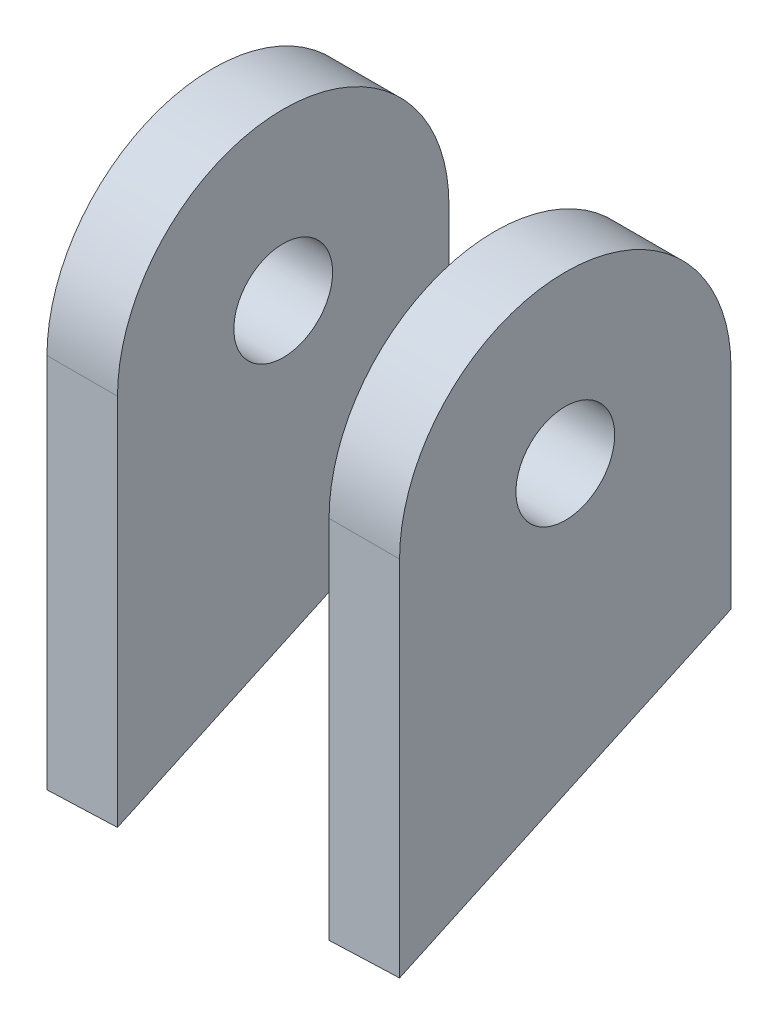
ISO-10303-21;
HEADER;
FILE_DESCRIPTION(('STEP AP214'),'2;1');
FILE_NAME('part.step','',(''),(''),'','','');
FILE_SCHEMA(('AUTOMOTIVE_DESIGN { 1 0 10303 214 1 1 1 1 }'));
ENDSEC;
DATA;
#1=APPLICATION_CONTEXT('core data for automotive mechanical design processes');
#2=APPLICATION_PROTOCOL_DEFINITION('international standard','automotive_design',2000,#1);
#3=PRODUCT_CONTEXT('',#1,'mechanical');
#4=PRODUCT('Part','Part','',(#3));
#5=PRODUCT_RELATED_PRODUCT_CATEGORY('part','',(#4));
#6=PRODUCT_DEFINITION_FORMATION('','',#4);
#7=PRODUCT_DEFINITION_CONTEXT('part definition',#1,'design');
#8=PRODUCT_DEFINITION('design','',#6,#7);
#9=PRODUCT_DEFINITION_SHAPE('','',#8);
#10=(LENGTH_UNIT() NAMED_UNIT(*) SI_UNIT(.MILLI.,.METRE.));
#11=(NAMED_UNIT(*) PLANE_ANGLE_UNIT() SI_UNIT($,.RADIAN.));
#12=(NAMED_UNIT(*) SI_UNIT($,.STERADIAN.) SOLID_ANGLE_UNIT());
#13=UNCERTAINTY_MEASURE_WITH_UNIT(LENGTH_MEASURE(1.E-05),#10,'distance_accuracy_value','');
#14=(GEOMETRIC_REPRESENTATION_CONTEXT(3) GLOBAL_UNCERTAINTY_ASSIGNED_CONTEXT((#13)) GLOBAL_UNIT_ASSIGNED_CONTEXT((#10,
#11,#12)) REPRESENTATION_CONTEXT('',''));
#15=CARTESIAN_POINT('',(0.,0.,0.));
#16=DIRECTION('',(0.,0.,1.));
#17=DIRECTION('',(1.,0.,0.));
#18=AXIS2_PLACEMENT_3D('',#15,#16,#17);
#19=CARTESIAN_POINT('',(-40.,0.,0.));
#20=DIRECTION('',(1.,0.,0.));
#21=DIRECTION('',(0.,0.,-1.));
#22=AXIS2_PLACEMENT_3D('',#19,#20,#21);
#23=CYLINDRICAL_SURFACE('',#22,23.5);
#24=DIRECTION('',(1.,0.,0.));
#25=VECTOR('',#24,1.);
#26=CARTESIAN_POINT('',(-39.9999999999995,-3.60822483003176E-13,23.4999999999997));
#27=LINE('',#26,#25);
#28=CARTESIAN_POINT('',(-39.9999999999995,-3.60822483003176E-13,23.4999999999997));
#29=VERTEX_POINT('',#28);
#30=CARTESIAN_POINT('',(-30.,0.,23.5000000000001));
#31=VERTEX_POINT('',#30);
#32=EDGE_CURVE('E110',#29,#31,#27,.T.);
#33=ORIENTED_EDGE('',*,*,#32,.T.);
#34=CARTESIAN_POINT('',(-30.,0.,0.));
#35=DIRECTION('',(1.,0.,0.));
#36=DIRECTION('',(0.,0.,-1.));
#37=AXIS2_PLACEMENT_3D('',#34,#35,#36);
#38=CIRCLE('',#37,23.5);
#39=CARTESIAN_POINT('',(-30.,0.,-23.5));
#40=VERTEX_POINT('',#39);
#41=EDGE_CURVE('E96',#40,#31,#38,.T.);
#42=ORIENTED_EDGE('',*,*,#41,.F.);
#43=DIRECTION('',(1.,0.,0.));
#44=VECTOR('',#43,1.);
#45=CARTESIAN_POINT('',(-40.,0.,-23.5000000000001));
#46=LINE('',#45,#44);
#47=CARTESIAN_POINT('',(-40.,0.,-23.5000000000001));
#48=VERTEX_POINT('',#47);
#49=EDGE_CURVE('E106',#48,#40,#46,.T.);
#50=ORIENTED_EDGE('',*,*,#49,.F.);
#51=CARTESIAN_POINT('',(-40.,0.,0.));
#52=DIRECTION('',(1.,0.,0.));
#53=DIRECTION('',(0.,0.,-1.));
#54=AXIS2_PLACEMENT_3D('',#51,#52,#53);
#55=CIRCLE('',#54,23.5);
#56=EDGE_CURVE('E109',#48,#29,#55,.T.);
#57=ORIENTED_EDGE('',*,*,#56,.T.);
#58=EDGE_LOOP('',(#33,#42,#50,#57));
#59=FACE_BOUND('',#58,.T.);
#60=ADVANCED_FACE('F44',(#59),#23,.T.);
#61=CARTESIAN_POINT('',(-40.,0.,-23.5000000000001));
#62=DIRECTION('',(0.,0.,-1.));
#63=DIRECTION('',(0.,1.,0.));
#64=AXIS2_PLACEMENT_3D('',#61,#62,#63);
#65=PLANE('',#64);
#66=DIRECTION('',(0.999284837213827,0.0378128829175845,0.));
#67=VECTOR('',#66,1.);
#68=CARTESIAN_POINT('',(-38.8081814025562,-31.4963092269572,-23.5000000000001));
#69=LINE('',#68,#67);
#70=CARTESIAN_POINT('',(-40.0000000000001,-31.541407576703,-23.5000000000001));
#71=VERTEX_POINT('',#70);
#72=CARTESIAN_POINT('',(-30.,-31.1630081303246,-23.5000000000001));
#73=VERTEX_POINT('',#72);
#74=EDGE_CURVE('E58',#71,#73,#69,.T.);
#75=ORIENTED_EDGE('',*,*,#74,.F.);
#76=DIRECTION('',(0.,1.,0.));
#77=VECTOR('',#76,1.);
#78=CARTESIAN_POINT('',(-40.,0.,-23.5000000000001));
#79=LINE('',#78,#77);
#80=EDGE_CURVE('E108',#71,#48,#79,.T.);
#81=ORIENTED_EDGE('',*,*,#80,.T.);
#82=ORIENTED_EDGE('',*,*,#49,.T.);
#83=DIRECTION('',(0.,1.,0.));
#84=VECTOR('',#83,1.);
#85=CARTESIAN_POINT('',(-30.,0.,-23.5));
#86=LINE('',#85,#84);
#87=EDGE_CURVE('E52',#73,#40,#86,.T.);
#88=ORIENTED_EDGE('',*,*,#87,.F.);
#89=EDGE_LOOP('',(#75,#81,#82,#88));
#90=FACE_BOUND('',#89,.T.);
#91=ADVANCED_FACE('F139',(#90),#65,.T.);
#92=CARTESIAN_POINT('',(-39.9999999999995,-3.60822483003176E-13,23.4999999999997));
#93=DIRECTION('',(0.,0.,1.));
#94=DIRECTION('',(0.,-1.,0.));
#95=AXIS2_PLACEMENT_3D('',#92,#93,#94);
#96=PLANE('',#95);
#97=DIRECTION('',(-0.999284837213827,-0.0378128829175845,0.));
#98=VECTOR('',#97,1.);
#99=CARTESIAN_POINT('',(-37.9846331258456,-53.2603018699993,23.5));
#100=LINE('',#99,#98);
#101=CARTESIAN_POINT('',(-29.9999999999994,-52.9581637945642,23.5000000000004));
#102=VERTEX_POINT('',#101);
#103=CARTESIAN_POINT('',(-39.9999999999995,-53.3365632409427,23.5000000000009));
#104=VERTEX_POINT('',#103);
#105=EDGE_CURVE('E82',#102,#104,#100,.T.);
#106=ORIENTED_EDGE('',*,*,#105,.F.);
#107=DIRECTION('',(0.,-1.,0.));
#108=VECTOR('',#107,1.);
#109=CARTESIAN_POINT('',(-30.,0.,23.5000000000001));
#110=LINE('',#109,#108);
#111=EDGE_CURVE('E89',#31,#102,#110,.T.);
#112=ORIENTED_EDGE('',*,*,#111,.F.);
#113=ORIENTED_EDGE('',*,*,#32,.F.);
#114=DIRECTION('',(0.,-1.,0.));
#115=VECTOR('',#114,1.);
#116=CARTESIAN_POINT('',(-39.9999999999995,-3.60822483003176E-13,23.4999999999997));
#117=LINE('',#116,#115);
#118=EDGE_CURVE('E92',#29,#104,#117,.T.);
#119=ORIENTED_EDGE('',*,*,#118,.T.);
#120=EDGE_LOOP('',(#106,#112,#113,#119));
#121=FACE_BOUND('',#120,.T.);
#122=ADVANCED_FACE('F88',(#121),#96,.T.);
#123=CARTESIAN_POINT('',(-40.,0.,0.));
#124=DIRECTION('',(1.,0.,0.));
#125=DIRECTION('',(0.,0.,-1.));
#126=AXIS2_PLACEMENT_3D('',#123,#124,#125);
#127=CYLINDRICAL_SURFACE('',#126,7.);
#128=CARTESIAN_POINT('',(-40.,0.,0.));
#129=DIRECTION('',(1.,0.,0.));
#130=DIRECTION('',(0.,0.,-1.));
#131=AXIS2_PLACEMENT_3D('',#128,#129,#130);
#132=CIRCLE('',#131,7.);
#133=CARTESIAN_POINT('',(-40.,0.,-7.));
#134=VERTEX_POINT('',#133);
#135=EDGE_CURVE('E99',#134,#134,#132,.T.);
#136=ORIENTED_EDGE('',*,*,#135,.F.);
#137=EDGE_LOOP('',(#136));
#138=FACE_BOUND('',#137,.T.);
#139=CARTESIAN_POINT('',(-30.,0.,0.));
#140=DIRECTION('',(1.,0.,0.));
#141=DIRECTION('',(0.,0.,-1.));
#142=AXIS2_PLACEMENT_3D('',#139,#140,#141);
#143=CIRCLE('',#142,7.);
#144=CARTESIAN_POINT('',(-30.,0.,-7.));
#145=VERTEX_POINT('',#144);
#146=EDGE_CURVE('E103',#145,#145,#143,.T.);
#147=ORIENTED_EDGE('',*,*,#146,.T.);
#148=EDGE_LOOP('',(#147));
#149=FACE_BOUND('',#148,.T.);
#150=ADVANCED_FACE('F46',(#138,#149),#127,.F.);
#151=CARTESIAN_POINT('',(-40.,0.,0.));
#152=DIRECTION('',(1.,0.,0.));
#153=DIRECTION('',(0.,0.,-1.));
#154=AXIS2_PLACEMENT_3D('',#151,#152,#153);
#155=PLANE('',#154);
#156=ORIENTED_EDGE('',*,*,#135,.T.);
#157=EDGE_LOOP('',(#156));
#158=FACE_BOUND('',#157,.T.);
#159=ORIENTED_EDGE('',*,*,#80,.F.);
#160=DIRECTION('',(0.,-0.420694068240691,0.907202568860504));
#161=VECTOR('',#160,1.);
#162=CARTESIAN_POINT('',(-39.9999999999999,-34.927985274914,-16.1970399171278));
#163=LINE('',#162,#161);
#164=EDGE_CURVE('E111',#71,#104,#163,.T.);
#165=ORIENTED_EDGE('',*,*,#164,.T.);
#166=ORIENTED_EDGE('',*,*,#118,.F.);
#167=ORIENTED_EDGE('',*,*,#56,.F.);
#168=EDGE_LOOP('',(#159,#165,#166,#167));
#169=FACE_BOUND('',#168,.T.);
#170=ADVANCED_FACE('F124',(#158,#169),#155,.F.);
#171=CARTESIAN_POINT('',(-30.,0.,0.));
#172=DIRECTION('',(1.,0.,0.));
#173=DIRECTION('',(0.,0.,-1.));
#174=AXIS2_PLACEMENT_3D('',#171,#172,#173);
#175=PLANE('',#174);
#176=DIRECTION('',(0.,-0.420694068240691,0.907202568860504));
#177=VECTOR('',#176,1.);
#178=CARTESIAN_POINT('',(-29.9999999999998,-34.6165562865956,-16.0526219750267));
#179=LINE('',#178,#177);
#180=EDGE_CURVE('E12',#73,#102,#179,.T.);
#181=ORIENTED_EDGE('',*,*,#180,.F.);
#182=ORIENTED_EDGE('',*,*,#87,.T.);
#183=ORIENTED_EDGE('',*,*,#41,.T.);
#184=ORIENTED_EDGE('',*,*,#111,.T.);
#185=EDGE_LOOP('',(#181,#182,#183,#184));
#186=FACE_BOUND('',#185,.T.);
#187=ORIENTED_EDGE('',*,*,#146,.F.);
#188=EDGE_LOOP('',(#187));
#189=FACE_BOUND('',#188,.T.);
#190=ADVANCED_FACE('F94',(#186,#189),#175,.T.);
#191=CARTESIAN_POINT('',(1.27303500394915,-33.6426233213026,-15.6009832391736));
#192=DIRECTION('',(-0.0343082857094844,0.906668496422527,0.420446404582782));
#193=DIRECTION('',(0.,-0.420694068240691,0.907202568860504));
#194=AXIS2_PLACEMENT_3D('',#191,#192,#193);
#195=PLANE('',#194);
#196=ORIENTED_EDGE('',*,*,#74,.T.);
#197=ORIENTED_EDGE('',*,*,#180,.T.);
#198=ORIENTED_EDGE('',*,*,#105,.T.);
#199=ORIENTED_EDGE('',*,*,#164,.F.);
#200=EDGE_LOOP('',(#196,#197,#198,#199));
#201=FACE_BOUND('',#200,.T.);
#202=ADVANCED_FACE('F81',(#201),#195,.F.);
#203=CLOSED_SHELL('',(#60,#91,#122,#150,#170,#190,#202));
#204=MANIFOLD_SOLID_BREP('B2',#203);
#205=CARTESIAN_POINT('',(-40.,0.,23.5));
#206=DIRECTION('',(0.,0.,1.));
#207=DIRECTION('',(0.,-1.,0.));
#208=AXIS2_PLACEMENT_3D('',#205,#206,#207);
#209=PLANE('',#208);
#210=DIRECTION('',(-0.999284837213825,-0.0378128829175847,0.));
#211=VECTOR('',#210,1.);
#212=CARTESIAN_POINT('',(-37.9846331258456,-53.2603018699992,23.5));
#213=LINE('',#212,#211);
#214=CARTESIAN_POINT('',(9.99999999999999,-51.4445660090511,23.5));
#215=VERTEX_POINT('',#214);
#216=CARTESIAN_POINT('',(0.,-51.8229654554293,23.5));
#217=VERTEX_POINT('',#216);
#218=EDGE_CURVE('E190',#215,#217,#213,.T.);
#219=ORIENTED_EDGE('',*,*,#218,.F.);
#220=DIRECTION('',(0.,-1.,0.));
#221=VECTOR('',#220,1.);
#222=CARTESIAN_POINT('',(10.,0.,23.5));
#223=LINE('',#222,#221);
#224=CARTESIAN_POINT('',(10.,0.,23.5));
#225=VERTEX_POINT('',#224);
#226=EDGE_CURVE('E239',#225,#215,#223,.T.);
#227=ORIENTED_EDGE('',*,*,#226,.F.);
#228=DIRECTION('',(1.,0.,0.));
#229=VECTOR('',#228,1.);
#230=CARTESIAN_POINT('',(-40.,0.,23.5));
#231=LINE('',#230,#229);
#232=CARTESIAN_POINT('',(0.,0.,23.5));
#233=VERTEX_POINT('',#232);
#234=EDGE_CURVE('E243',#233,#225,#231,.T.);
#235=ORIENTED_EDGE('',*,*,#234,.F.);
#236=DIRECTION('',(0.,-1.,0.));
#237=VECTOR('',#236,1.);
#238=CARTESIAN_POINT('',(0.,0.,23.5));
#239=LINE('',#238,#237);
#240=EDGE_CURVE('E230',#233,#217,#239,.T.);
#241=ORIENTED_EDGE('',*,*,#240,.T.);
#242=EDGE_LOOP('',(#219,#227,#235,#241));
#243=FACE_BOUND('',#242,.T.);
#244=ADVANCED_FACE('F175',(#243),#209,.T.);
#245=CARTESIAN_POINT('',(-40.,0.,-23.5));
#246=DIRECTION('',(0.,0.,-1.));
#247=DIRECTION('',(0.,1.,0.));
#248=AXIS2_PLACEMENT_3D('',#245,#246,#247);
#249=PLANE('',#248);
#250=DIRECTION('',(0.999284837213825,0.0378128829175847,0.));
#251=VECTOR('',#250,1.);
#252=CARTESIAN_POINT('',(-38.8081814025563,-31.4963092269572,-23.5));
#253=LINE('',#252,#251);
#254=CARTESIAN_POINT('',(0.,-30.02780979119,-23.5));
#255=VERTEX_POINT('',#254);
#256=CARTESIAN_POINT('',(10.,-29.6494103448118,-23.5));
#257=VERTEX_POINT('',#256);
#258=EDGE_CURVE('E216',#255,#257,#253,.T.);
#259=ORIENTED_EDGE('',*,*,#258,.F.);
#260=DIRECTION('',(0.,1.,0.));
#261=VECTOR('',#260,1.);
#262=CARTESIAN_POINT('',(0.,0.,-23.5));
#263=LINE('',#262,#261);
#264=CARTESIAN_POINT('',(0.,0.,-23.5));
#265=VERTEX_POINT('',#264);
#266=EDGE_CURVE('E222',#255,#265,#263,.T.);
#267=ORIENTED_EDGE('',*,*,#266,.T.);
#268=DIRECTION('',(1.,0.,0.));
#269=VECTOR('',#268,1.);
#270=CARTESIAN_POINT('',(-40.,0.,-23.5));
#271=LINE('',#270,#269);
#272=CARTESIAN_POINT('',(10.,0.,-23.5));
#273=VERTEX_POINT('',#272);
#274=EDGE_CURVE('E183',#265,#273,#271,.T.);
#275=ORIENTED_EDGE('',*,*,#274,.T.);
#276=DIRECTION('',(0.,1.,0.));
#277=VECTOR('',#276,1.);
#278=CARTESIAN_POINT('',(10.,0.,-23.5));
#279=LINE('',#278,#277);
#280=EDGE_CURVE('E197',#257,#273,#279,.T.);
#281=ORIENTED_EDGE('',*,*,#280,.F.);
#282=EDGE_LOOP('',(#259,#267,#275,#281));
#283=FACE_BOUND('',#282,.T.);
#284=ADVANCED_FACE('F221',(#283),#249,.T.);
#285=CARTESIAN_POINT('',(-40.,0.,0.));
#286=DIRECTION('',(1.,0.,0.));
#287=DIRECTION('',(0.,0.,-1.));
#288=AXIS2_PLACEMENT_3D('',#285,#286,#287);
#289=CYLINDRICAL_SURFACE('',#288,23.5);
#290=CARTESIAN_POINT('',(0.,0.,0.));
#291=DIRECTION('',(1.,0.,0.));
#292=DIRECTION('',(0.,0.,-1.));
#293=AXIS2_PLACEMENT_3D('',#290,#291,#292);
#294=CIRCLE('',#293,23.5);
#295=EDGE_CURVE('E227',#265,#233,#294,.T.);
#296=ORIENTED_EDGE('',*,*,#295,.T.);
#297=ORIENTED_EDGE('',*,*,#234,.T.);
#298=CARTESIAN_POINT('',(10.,0.,0.));
#299=DIRECTION('',(1.,0.,0.));
#300=DIRECTION('',(0.,0.,-1.));
#301=AXIS2_PLACEMENT_3D('',#298,#299,#300);
#302=CIRCLE('',#301,23.5);
#303=EDGE_CURVE('E233',#273,#225,#302,.T.);
#304=ORIENTED_EDGE('',*,*,#303,.F.);
#305=ORIENTED_EDGE('',*,*,#274,.F.);
#306=EDGE_LOOP('',(#296,#297,#304,#305));
#307=FACE_BOUND('',#306,.T.);
#308=ADVANCED_FACE('F177',(#307),#289,.T.);
#309=CARTESIAN_POINT('',(10.,0.,0.));
#310=DIRECTION('',(1.,0.,0.));
#311=DIRECTION('',(0.,0.,-1.));
#312=AXIS2_PLACEMENT_3D('',#309,#310,#311);
#313=PLANE('',#312);
#314=DIRECTION('',(0.,-0.42069406824069,0.907202568860504));
#315=VECTOR('',#314,1.);
#316=CARTESIAN_POINT('',(10.,-33.3708403333214,-15.4749502066216));
#317=LINE('',#316,#315);
#318=EDGE_CURVE('E251',#257,#215,#317,.T.);
#319=ORIENTED_EDGE('',*,*,#318,.F.);
#320=ORIENTED_EDGE('',*,*,#280,.T.);
#321=ORIENTED_EDGE('',*,*,#303,.T.);
#322=ORIENTED_EDGE('',*,*,#226,.T.);
#323=EDGE_LOOP('',(#319,#320,#321,#322));
#324=FACE_BOUND('',#323,.T.);
#325=CARTESIAN_POINT('',(10.,0.,0.));
#326=DIRECTION('',(1.,0.,0.));
#327=DIRECTION('',(0.,0.,-1.));
#328=AXIS2_PLACEMENT_3D('',#325,#326,#327);
#329=CIRCLE('',#328,7.);
#330=CARTESIAN_POINT('',(10.,0.,-7.));
#331=VERTEX_POINT('',#330);
#332=EDGE_CURVE('E229',#331,#331,#329,.T.);
#333=ORIENTED_EDGE('',*,*,#332,.F.);
#334=EDGE_LOOP('',(#333));
#335=FACE_BOUND('',#334,.T.);
#336=ADVANCED_FACE('F249',(#324,#335),#313,.T.);
#337=CARTESIAN_POINT('',(-40.,0.,0.));
#338=DIRECTION('',(1.,0.,0.));
#339=DIRECTION('',(0.,0.,-1.));
#340=AXIS2_PLACEMENT_3D('',#337,#338,#339);
#341=CYLINDRICAL_SURFACE('',#340,7.);
#342=CARTESIAN_POINT('',(0.,0.,0.));
#343=DIRECTION('',(1.,0.,0.));
#344=DIRECTION('',(0.,0.,-1.));
#345=AXIS2_PLACEMENT_3D('',#342,#343,#344);
#346=CIRCLE('',#345,7.);
#347=CARTESIAN_POINT('',(0.,0.,-7.));
#348=VERTEX_POINT('',#347);
#349=EDGE_CURVE('E313',#348,#348,#346,.T.);
#350=ORIENTED_EDGE('',*,*,#349,.F.);
#351=EDGE_LOOP('',(#350));
#352=FACE_BOUND('',#351,.T.);
#353=ORIENTED_EDGE('',*,*,#332,.T.);
#354=EDGE_LOOP('',(#353));
#355=FACE_BOUND('',#354,.T.);
#356=ADVANCED_FACE('F253',(#352,#355),#341,.F.);
#357=CARTESIAN_POINT('',(0.,0.,0.));
#358=DIRECTION('',(1.,0.,0.));
#359=DIRECTION('',(0.,0.,-1.));
#360=AXIS2_PLACEMENT_3D('',#357,#358,#359);
#361=PLANE('',#360);
#362=ORIENTED_EDGE('',*,*,#349,.T.);
#363=EDGE_LOOP('',(#362));
#364=FACE_BOUND('',#363,.T.);
#365=ORIENTED_EDGE('',*,*,#266,.F.);
#366=DIRECTION('',(0.,-0.42069406824069,0.907202568860504));
#367=VECTOR('',#366,1.);
#368=CARTESIAN_POINT('',(0.,-33.68226932164,-15.6193681487229));
#369=LINE('',#368,#367);
#370=EDGE_CURVE('E42',#255,#217,#369,.T.);
#371=ORIENTED_EDGE('',*,*,#370,.T.);
#372=ORIENTED_EDGE('',*,*,#240,.F.);
#373=ORIENTED_EDGE('',*,*,#295,.F.);
#374=EDGE_LOOP('',(#365,#371,#372,#373));
#375=FACE_BOUND('',#374,.T.);
#376=ADVANCED_FACE('F225',(#364,#375),#361,.F.);
#377=CARTESIAN_POINT('',(1.27303500394914,-33.6426233213026,-15.6009832391735));
#378=DIRECTION('',(-0.0343082857094845,0.906668496422528,0.420446404582783));
#379=DIRECTION('',(0.,-0.42069406824069,0.907202568860504));
#380=AXIS2_PLACEMENT_3D('',#377,#378,#379);
#381=PLANE('',#380);
#382=ORIENTED_EDGE('',*,*,#318,.T.);
#383=ORIENTED_EDGE('',*,*,#218,.T.);
#384=ORIENTED_EDGE('',*,*,#370,.F.);
#385=ORIENTED_EDGE('',*,*,#258,.T.);
#386=EDGE_LOOP('',(#382,#383,#384,#385));
#387=FACE_BOUND('',#386,.T.);
#388=ADVANCED_FACE('F215',(#387),#381,.F.);
#389=CLOSED_SHELL('',(#244,#284,#308,#336,#356,#376,#388));
#390=MANIFOLD_SOLID_BREP('B6',#389);
#391=ADVANCED_BREP_SHAPE_REPRESENTATION('',(#18,#204,#390),#14);
#392=SHAPE_DEFINITION_REPRESENTATION(#9,#391);
ENDSEC;
END-ISO-10303-21;
